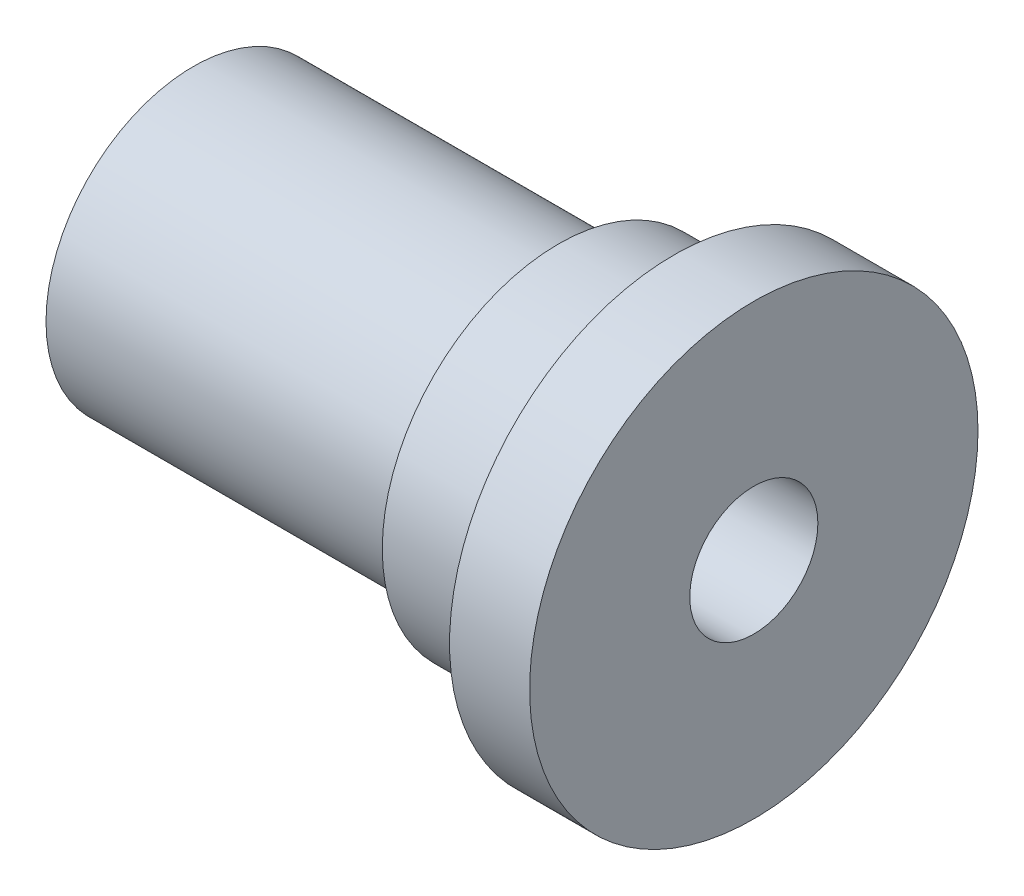
ISO-10303-21;
HEADER;
FILE_DESCRIPTION(('STEP AP214'),'2;1');
FILE_NAME('part.step','',(''),(''),'','','');
FILE_SCHEMA(('AUTOMOTIVE_DESIGN { 1 0 10303 214 1 1 1 1 }'));
ENDSEC;
DATA;
#1=APPLICATION_CONTEXT('core data for automotive mechanical design processes');
#2=APPLICATION_PROTOCOL_DEFINITION('international standard','automotive_design',2000,#1);
#3=PRODUCT_CONTEXT('',#1,'mechanical');
#4=PRODUCT('Part','Part','',(#3));
#5=PRODUCT_RELATED_PRODUCT_CATEGORY('part','',(#4));
#6=PRODUCT_DEFINITION_FORMATION('','',#4);
#7=PRODUCT_DEFINITION_CONTEXT('part definition',#1,'design');
#8=PRODUCT_DEFINITION('design','',#6,#7);
#9=PRODUCT_DEFINITION_SHAPE('','',#8);
#10=(LENGTH_UNIT() NAMED_UNIT(*) SI_UNIT(.MILLI.,.METRE.));
#11=(NAMED_UNIT(*) PLANE_ANGLE_UNIT() SI_UNIT($,.RADIAN.));
#12=(NAMED_UNIT(*) SI_UNIT($,.STERADIAN.) SOLID_ANGLE_UNIT());
#13=UNCERTAINTY_MEASURE_WITH_UNIT(LENGTH_MEASURE(1.E-05),#10,'distance_accuracy_value','');
#14=(GEOMETRIC_REPRESENTATION_CONTEXT(3) GLOBAL_UNCERTAINTY_ASSIGNED_CONTEXT((#13)) GLOBAL_UNIT_ASSIGNED_CONTEXT((#10,
#11,#12)) REPRESENTATION_CONTEXT('',''));
#15=CARTESIAN_POINT('',(0.,0.,0.));
#16=DIRECTION('',(0.,0.,1.));
#17=DIRECTION('',(1.,0.,0.));
#18=AXIS2_PLACEMENT_3D('',#15,#16,#17);
#19=CARTESIAN_POINT('',(-7.2,0.,-11.));
#20=DIRECTION('',(-1.,0.,0.));
#21=DIRECTION('',(0.,0.,1.));
#22=AXIS2_PLACEMENT_3D('',#19,#20,#21);
#23=PLANE('',#22);
#24=CARTESIAN_POINT('',(-7.2,0.,0.));
#25=DIRECTION('',(1.,0.,0.));
#26=DIRECTION('',(0.,0.,-1.));
#27=AXIS2_PLACEMENT_3D('',#24,#25,#26);
#28=CIRCLE('',#27,9.19999999999999);
#29=CARTESIAN_POINT('',(-7.2,0.,-9.2));
#30=VERTEX_POINT('',#29);
#31=EDGE_CURVE('E66',#30,#30,#28,.T.);
#32=ORIENTED_EDGE('',*,*,#31,.T.);
#33=EDGE_LOOP('',(#32));
#34=FACE_BOUND('',#33,.T.);
#35=CARTESIAN_POINT('',(-7.2,0.,0.));
#36=DIRECTION('',(1.,0.,0.));
#37=DIRECTION('',(0.,0.,-1.));
#38=AXIS2_PLACEMENT_3D('',#35,#36,#37);
#39=CIRCLE('',#38,11.);
#40=CARTESIAN_POINT('',(-7.2,0.,-11.));
#41=VERTEX_POINT('',#40);
#42=EDGE_CURVE('E10',#41,#41,#39,.T.);
#43=ORIENTED_EDGE('',*,*,#42,.F.);
#44=EDGE_LOOP('',(#43));
#45=FACE_BOUND('',#44,.T.);
#46=ADVANCED_FACE('F33',(#34,#45),#23,.T.);
#47=CARTESIAN_POINT('',(-18.,0.,0.));
#48=DIRECTION('',(1.,0.,0.));
#49=DIRECTION('',(0.,0.,-1.));
#50=AXIS2_PLACEMENT_3D('',#47,#48,#49);
#51=CYLINDRICAL_SURFACE('',#50,11.);
#52=ORIENTED_EDGE('',*,*,#42,.T.);
#53=EDGE_LOOP('',(#52));
#54=FACE_BOUND('',#53,.T.);
#55=CARTESIAN_POINT('',(0.,0.,0.));
#56=DIRECTION('',(1.,0.,0.));
#57=DIRECTION('',(0.,0.,-1.));
#58=AXIS2_PLACEMENT_3D('',#55,#56,#57);
#59=CIRCLE('',#58,11.);
#60=CARTESIAN_POINT('',(0.,0.,-11.));
#61=VERTEX_POINT('',#60);
#62=EDGE_CURVE('E45',#61,#61,#59,.T.);
#63=ORIENTED_EDGE('',*,*,#62,.F.);
#64=EDGE_LOOP('',(#63));
#65=FACE_BOUND('',#64,.T.);
#66=ADVANCED_FACE('F101',(#54,#65),#51,.T.);
#67=CARTESIAN_POINT('',(0.,0.,-11.));
#68=DIRECTION('',(-1.,0.,0.));
#69=DIRECTION('',(0.,0.,1.));
#70=AXIS2_PLACEMENT_3D('',#67,#68,#69);
#71=PLANE('',#70);
#72=ORIENTED_EDGE('',*,*,#62,.T.);
#73=EDGE_LOOP('',(#72));
#74=FACE_BOUND('',#73,.T.);
#75=CARTESIAN_POINT('',(0.,0.,0.));
#76=DIRECTION('',(1.,0.,0.));
#77=DIRECTION('',(0.,0.,-1.));
#78=AXIS2_PLACEMENT_3D('',#75,#76,#77);
#79=CIRCLE('',#78,14.);
#80=CARTESIAN_POINT('',(0.,0.,-14.));
#81=VERTEX_POINT('',#80);
#82=EDGE_CURVE('E49',#81,#81,#79,.T.);
#83=ORIENTED_EDGE('',*,*,#82,.F.);
#84=EDGE_LOOP('',(#83));
#85=FACE_BOUND('',#84,.T.);
#86=ADVANCED_FACE('F106',(#74,#85),#71,.T.);
#87=CARTESIAN_POINT('',(-18.,0.,0.));
#88=DIRECTION('',(1.,0.,0.));
#89=DIRECTION('',(0.,0.,-1.));
#90=AXIS2_PLACEMENT_3D('',#87,#88,#89);
#91=CYLINDRICAL_SURFACE('',#90,14.);
#92=ORIENTED_EDGE('',*,*,#82,.T.);
#93=EDGE_LOOP('',(#92));
#94=FACE_BOUND('',#93,.T.);
#95=CARTESIAN_POINT('',(5.,0.,0.));
#96=DIRECTION('',(1.,0.,0.));
#97=DIRECTION('',(0.,0.,-1.));
#98=AXIS2_PLACEMENT_3D('',#95,#96,#97);
#99=CIRCLE('',#98,14.);
#100=CARTESIAN_POINT('',(5.,0.,-14.));
#101=VERTEX_POINT('',#100);
#102=EDGE_CURVE('E54',#101,#101,#99,.T.);
#103=ORIENTED_EDGE('',*,*,#102,.F.);
#104=EDGE_LOOP('',(#103));
#105=FACE_BOUND('',#104,.T.);
#106=ADVANCED_FACE('F113',(#94,#105),#91,.T.);
#107=CARTESIAN_POINT('',(5.,0.,-14.));
#108=DIRECTION('',(1.,0.,0.));
#109=DIRECTION('',(0.,0.,-1.));
#110=AXIS2_PLACEMENT_3D('',#107,#108,#109);
#111=PLANE('',#110);
#112=ORIENTED_EDGE('',*,*,#102,.T.);
#113=EDGE_LOOP('',(#112));
#114=FACE_BOUND('',#113,.T.);
#115=CARTESIAN_POINT('',(5.,0.,0.));
#116=DIRECTION('',(1.,0.,0.));
#117=DIRECTION('',(0.,0.,-1.));
#118=AXIS2_PLACEMENT_3D('',#115,#116,#117);
#119=CIRCLE('',#118,4.);
#120=CARTESIAN_POINT('',(5.,0.,-4.));
#121=VERTEX_POINT('',#120);
#122=EDGE_CURVE('E57',#121,#121,#119,.T.);
#123=ORIENTED_EDGE('',*,*,#122,.F.);
#124=EDGE_LOOP('',(#123));
#125=FACE_BOUND('',#124,.T.);
#126=ADVANCED_FACE('F98',(#114,#125),#111,.T.);
#127=CARTESIAN_POINT('',(-18.,0.,0.));
#128=DIRECTION('',(1.,0.,0.));
#129=DIRECTION('',(0.,0.,-1.));
#130=AXIS2_PLACEMENT_3D('',#127,#128,#129);
#131=CYLINDRICAL_SURFACE('',#130,4.);
#132=CARTESIAN_POINT('',(-11.,-3.12249899919919,2.5));
#133=CARTESIAN_POINT('',(-10.9378432485545,-3.1224999155542,2.4999994109714));
#134=CARTESIAN_POINT('',(-10.8756740533292,-3.12436490733916,2.49767581942173));
#135=CARTESIAN_POINT('',(-10.7518828204523,-3.13172923119025,2.48843349840857));
#136=CARTESIAN_POINT('',(-10.6902611267429,-3.13723070381364,2.48151206248433));
#137=CARTESIAN_POINT('',(-10.5067739522563,-3.15888953558504,2.45397595058365));
#138=CARTESIAN_POINT('',(-10.386451668811,-3.18020036271142,2.42658990946459));
#139=CARTESIAN_POINT('',(-10.1544018021218,-3.23299770760367,2.35576217141198));
#140=CARTESIAN_POINT('',(-10.0426095849449,-3.26439575383209,2.31245961359202));
#141=CARTESIAN_POINT('',(-9.82799147466594,-3.33366000884439,2.21143916430899));
#142=CARTESIAN_POINT('',(-9.72516582624691,-3.37152639405534,2.15372087963017));
#143=CARTESIAN_POINT('',(-9.51626601869634,-3.45559225121875,2.01647682425578));
#144=CARTESIAN_POINT('',(-9.41160667499548,-3.50222814511577,1.93506425666949));
#145=CARTESIAN_POINT('',(-9.2162384483762,-3.59505503533367,1.75662526657432));
#146=CARTESIAN_POINT('',(-9.12554172004638,-3.64124561158438,1.65958538899782));
#147=CARTESIAN_POINT('',(-8.94977970182732,-3.73459524771314,1.43833990582854));
#148=CARTESIAN_POINT('',(-8.86671381554957,-3.78119887781504,1.31226934259652));
#149=CARTESIAN_POINT('',(-8.75945484526376,-3.84307251838774,1.11163395543429));
#150=CARTESIAN_POINT('',(-8.72658486166689,-3.86236283092051,1.04281240974104));
#151=CARTESIAN_POINT('',(-8.66704531463672,-3.89770436975436,0.901758767615551));
#152=CARTESIAN_POINT('',(-8.64037146896158,-3.91375783207117,0.829529068393798));
#153=CARTESIAN_POINT('',(-8.59601618474372,-3.94066759113823,0.689700297916578));
#154=CARTESIAN_POINT('',(-8.57769802348189,-3.95188535984465,0.62237198127859));
#155=CARTESIAN_POINT('',(-8.54669771368665,-3.97096241909161,0.485997575898809));
#156=CARTESIAN_POINT('',(-8.53401231078379,-3.97882364879721,0.416952503441684));
#157=CARTESIAN_POINT('',(-8.51448620236546,-3.99095470334737,0.277765449857175));
#158=CARTESIAN_POINT('',(-8.50764188348659,-3.99522674847834,0.207624174243907));
#159=CARTESIAN_POINT('',(-8.49990078661078,-4.00006125072437,0.0669114466599399));
#160=CARTESIAN_POINT('',(-8.49900332403665,-4.00062413482248,-0.00365995486027804));
#161=CARTESIAN_POINT('',(-8.50472537354725,-3.99704479619502,-0.196045081555538));
#162=CARTESIAN_POINT('',(-8.51730650307888,-3.98917040897436,-0.317681845488535));
#163=CARTESIAN_POINT('',(-8.55973021796612,-3.96290903275931,-0.556636494620255));
#164=CARTESIAN_POINT('',(-8.58957410797362,-3.94452124920477,-0.673954052677426));
#165=CARTESIAN_POINT('',(-8.66520855928326,-3.89876170711609,-0.901771991763866));
#166=CARTESIAN_POINT('',(-8.71103991957107,-3.87136697381047,-1.01225407159606));
#167=CARTESIAN_POINT('',(-8.81693723898429,-3.80971291751354,-1.22404012071223));
#168=CARTESIAN_POINT('',(-8.87700644106365,-3.77545203089318,-1.32534199174245));
#169=CARTESIAN_POINT('',(-9.01805641692367,-3.69786441247166,-1.52942649744658));
#170=CARTESIAN_POINT('',(-9.10070927669048,-3.65394006381521,-1.63082454612907));
#171=CARTESIAN_POINT('',(-9.28026473720707,-3.56390927740507,-1.81919733573062));
#172=CARTESIAN_POINT('',(-9.37718804638397,-3.51779973570409,-1.90615071842624));
#173=CARTESIAN_POINT('',(-9.59741125317348,-3.42142883464466,-2.07470887167909));
#174=CARTESIAN_POINT('',(-9.72250276335808,-3.37141162686597,-2.15413229677844));
#175=CARTESIAN_POINT('',(-9.98729223730141,-3.28028278192382,-2.29052307550563));
#176=CARTESIAN_POINT('',(-10.1269626874531,-3.23915480386931,-2.34753179448504));
#177=CARTESIAN_POINT('',(-10.3795388061062,-3.18183753131763,-2.42437133527931));
#178=CARTESIAN_POINT('',(-10.4898219252135,-3.16193408602513,-2.45003683445404));
#179=CARTESIAN_POINT('',(-10.7142303775599,-3.13358277759547,-2.48620337073091));
#180=CARTESIAN_POINT('',(-10.8283502426568,-3.12511926504439,-2.49672512520811));
#181=CARTESIAN_POINT('',(-11.0574573605024,-3.12092267030677,-2.5019707209518));
#182=CARTESIAN_POINT('',(-11.1724460004785,-3.12521876170185,-2.49665835896695));
#183=CARTESIAN_POINT('',(-11.3995611643185,-3.14592085836188,-2.47051466367814));
#184=CARTESIAN_POINT('',(-11.5116852383712,-3.16233689222906,-2.44967047849126));
#185=CARTESIAN_POINT('',(-11.7284367594257,-3.20460120797143,-2.39409874195038));
#186=CARTESIAN_POINT('',(-11.8331573158943,-3.23028954367817,-2.35960571424757));
#187=CARTESIAN_POINT('',(-12.0355746998938,-3.28831148388749,-2.27804893702243));
#188=CARTESIAN_POINT('',(-12.133269018878,-3.32064744602081,-2.23098072583746));
#189=CARTESIAN_POINT('',(-12.3386119416632,-3.39574401285203,-2.11530798730694));
#190=CARTESIAN_POINT('',(-12.4446145273018,-3.43931724293015,-2.04430931160543));
#191=CARTESIAN_POINT('',(-12.6443706606543,-3.52787943213338,-1.88737868921489));
#192=CARTESIAN_POINT('',(-12.7381113212423,-3.57286982004467,-1.80143124902619));
#193=CARTESIAN_POINT('',(-12.925964070641,-3.66766209459505,-1.6007693249212));
#194=CARTESIAN_POINT('',(-13.0177273984849,-3.71707933883201,-1.48365201617176));
#195=CARTESIAN_POINT('',(-13.1801470147197,-3.80768973398606,-1.23256787407809));
#196=CARTESIAN_POINT('',(-13.2508131951269,-3.84888673619009,-1.09860897940973));
#197=CARTESIAN_POINT('',(-13.336581067975,-3.89988966499776,-0.891930804655075));
#198=CARTESIAN_POINT('',(-13.3612974439513,-3.91477055097245,-0.824318196039414));
#199=CARTESIAN_POINT('',(-13.4049382767323,-3.94124643918618,-0.686640792876416));
#200=CARTESIAN_POINT('',(-13.4238660861509,-3.95284334314805,-0.616577444051129));
#201=CARTESIAN_POINT('',(-13.4556058301393,-3.9723851203995,-0.474639231464257));
#202=CARTESIAN_POINT('',(-13.4684230995164,-3.98033317908836,-0.402766005755501));
#203=CARTESIAN_POINT('',(-13.4877391722929,-3.99234168343343,-0.257881807142455));
#204=CARTESIAN_POINT('',(-13.4942390209308,-3.99640277220024,-0.184871024482528));
#205=CARTESIAN_POINT('',(-13.5030715155071,-4.00191521492706,0.013110277424899));
#206=CARTESIAN_POINT('',(-13.4992657929094,-3.99952706123947,0.138539079205457));
#207=CARTESIAN_POINT('',(-13.4730824104545,-3.98321975018362,0.386583137102138));
#208=CARTESIAN_POINT('',(-13.4507055933212,-3.96930111604857,0.509198520626837));
#209=CARTESIAN_POINT('',(-13.3896775844539,-3.93192083384285,0.744080605483855));
#210=CARTESIAN_POINT('',(-13.3516179264353,-3.90880701054803,0.856558752631817));
#211=CARTESIAN_POINT('',(-13.2608805375565,-3.85489971248843,1.07343034721918));
#212=CARTESIAN_POINT('',(-13.2082003404328,-3.82410494215308,1.17782242685803));
#213=CARTESIAN_POINT('',(-13.08367872128,-3.75350673935648,1.38731297754798));
#214=CARTESIAN_POINT('',(-13.0104160092425,-3.71310001864656,1.4913601218378));
#215=CARTESIAN_POINT('',(-12.8498467674859,-3.62867283985205,1.68643334934803));
#216=CARTESIAN_POINT('',(-12.7625243911657,-3.58464833191203,1.77744451843681));
#217=CARTESIAN_POINT('',(-12.5617674849381,-3.49000828219718,1.95744716561589));
#218=CARTESIAN_POINT('',(-12.4463833874286,-3.43935738427103,2.04425661250064));
#219=CARTESIAN_POINT('',(-12.2007105902402,-3.34349647457111,2.19754648509905));
#220=CARTESIAN_POINT('',(-12.0704301888475,-3.29828346204189,2.26403815415028));
#221=CARTESIAN_POINT('',(-11.8271946992151,-3.2285953978009,2.36198229412841));
#222=CARTESIAN_POINT('',(-11.7167294278464,-3.20174639338769,2.3979245857683));
#223=CARTESIAN_POINT('',(-11.4900606569982,-3.15878358104509,2.45425618419746));
#224=CARTESIAN_POINT('',(-11.3738765802003,-3.14263581150428,2.47469472410168));
#225=CARTESIAN_POINT('',(-11.2139400053539,-3.12952857640607,2.49119847139522));
#226=CARTESIAN_POINT('',(-11.1712744742913,-3.1268999430677,2.4944943383796));
#227=CARTESIAN_POINT('',(-11.0857413010483,-3.12338461939862,2.49889558125807));
#228=CARTESIAN_POINT('',(-11.0428736107566,-3.12249836712871,2.50000040629188));
#229=CARTESIAN_POINT('',(-11.,-3.12249899919919,2.5));
#230=B_SPLINE_CURVE_WITH_KNOTS('',3,(#132,#133,#134,#135,#136,#137,#138,#139,#140,#141,#142,
#143,#144,#145,#146,#147,#148,#149,#150,#151,#152,#153,#154,#155,#156,#157,#158,#159,#160,#161,
#162,#163,#164,#165,#166,#167,#168,#169,#170,#171,#172,#173,#174,#175,#176,#177,#178,#179,#180,
#181,#182,#183,#184,#185,#186,#187,#188,#189,#190,#191,#192,#193,#194,#195,#196,#197,#198,#199,
#200,#201,#202,#203,#204,#205,#206,#207,#208,#209,#210,#211,#212,#213,#214,#215,#216,#217,#218,
#219,#220,#221,#222,#223,#224,#225,#226,#227,#228,#229),.UNSPECIFIED.,.T.,.F.,(4,2,2,2,2,2,2,2,
2,2,2,2,2,2,2,2,2,2,2,2,2,2,2,2,2,2,2,2,2,2,2,2,2,2,2,2,2,2,2,2,2,2,2,2,2,2,2,2,4),(0.,
0.186415315858459,0.372940459994496,0.746478880764687,1.11682668423133,1.48718459072605,
1.9072279868507,2.32763499192879,2.7987602926597,3.03445880867314,3.26999394209509,
3.48170145743206,3.69328649746504,3.90474055342595,4.11617026725867,4.48184709708114,
4.84755156693919,5.21419620193004,5.58092442797435,5.99329080205307,6.40626158573465,
6.87316206383505,7.33919680735486,7.68265621505466,8.02564530559509,8.36941921026407,
8.71347788865091,9.05186495232126,9.39037223519201,9.79332737765188,10.1967026751544,
10.6647326786671,11.1325428866819,11.3527929661039,11.5729152387447,11.7928449800804,
12.0127383271002,12.3871595324234,12.7615637480926,13.1229788842094,13.4844550226785,
13.8834503840958,14.2828986410983,14.7399238503459,15.1966956936287,15.5530255473292,
15.9082190611886,16.0367696833384,16.1653526209168),.UNSPECIFIED.);
#231=CARTESIAN_POINT('',(-11.,-3.12249899919919,2.5));
#232=VERTEX_POINT('',#231);
#233=EDGE_CURVE('E69',#232,#232,#230,.T.);
#234=ORIENTED_EDGE('',*,*,#233,.F.);
#235=EDGE_LOOP('',(#234));
#236=FACE_BOUND('',#235,.T.);
#237=ORIENTED_EDGE('',*,*,#122,.T.);
#238=EDGE_LOOP('',(#237));
#239=FACE_BOUND('',#238,.T.);
#240=CARTESIAN_POINT('',(-18.,0.,0.));
#241=DIRECTION('',(1.,0.,0.));
#242=DIRECTION('',(0.,0.,-1.));
#243=AXIS2_PLACEMENT_3D('',#240,#241,#242);
#244=CIRCLE('',#243,4.);
#245=CARTESIAN_POINT('',(-18.,0.,-4.));
#246=VERTEX_POINT('',#245);
#247=EDGE_CURVE('E60',#246,#246,#244,.T.);
#248=ORIENTED_EDGE('',*,*,#247,.F.);
#249=EDGE_LOOP('',(#248));
#250=FACE_BOUND('',#249,.T.);
#251=ADVANCED_FACE('F75',(#236,#239,#250),#131,.F.);
#252=CARTESIAN_POINT('',(-18.,0.,-4.));
#253=DIRECTION('',(1.,0.,0.));
#254=DIRECTION('',(0.,0.,-1.));
#255=AXIS2_PLACEMENT_3D('',#252,#253,#254);
#256=PLANE('',#255);
#257=ORIENTED_EDGE('',*,*,#247,.T.);
#258=EDGE_LOOP('',(#257));
#259=FACE_BOUND('',#258,.T.);
#260=ADVANCED_FACE('F91',(#259),#256,.T.);
#261=CARTESIAN_POINT('',(-30.,0.,-9.2));
#262=DIRECTION('',(-1.,0.,0.));
#263=DIRECTION('',(0.,0.,1.));
#264=AXIS2_PLACEMENT_3D('',#261,#262,#263);
#265=PLANE('',#264);
#266=CARTESIAN_POINT('',(-30.,0.,0.));
#267=DIRECTION('',(1.,0.,0.));
#268=DIRECTION('',(0.,0.,-1.));
#269=AXIS2_PLACEMENT_3D('',#266,#267,#268);
#270=CIRCLE('',#269,9.2);
#271=CARTESIAN_POINT('',(-30.,0.,-9.2));
#272=VERTEX_POINT('',#271);
#273=EDGE_CURVE('E63',#272,#272,#270,.T.);
#274=ORIENTED_EDGE('',*,*,#273,.F.);
#275=EDGE_LOOP('',(#274));
#276=FACE_BOUND('',#275,.T.);
#277=ADVANCED_FACE('F88',(#276),#265,.T.);
#278=CARTESIAN_POINT('',(-18.,0.,0.));
#279=DIRECTION('',(1.,0.,0.));
#280=DIRECTION('',(0.,0.,-1.));
#281=AXIS2_PLACEMENT_3D('',#278,#279,#280);
#282=CYLINDRICAL_SURFACE('',#281,9.2);
#283=CARTESIAN_POINT('',(-11.,-8.85381273802422,2.5));
#284=CARTESIAN_POINT('',(-11.1376148042566,-8.85381502180112,2.49999688641659));
#285=CARTESIAN_POINT('',(-11.275262139519,-8.85705624026203,2.4885985927202));
#286=CARTESIAN_POINT('',(-11.5465744252871,-8.86963028898469,2.44339742072519));
#287=CARTESIAN_POINT('',(-11.680237445644,-8.878966023072,2.4095838622107));
#288=CARTESIAN_POINT('',(-11.9396167494603,-8.90259542782654,2.32075147686319));
#289=CARTESIAN_POINT('',(-12.0653441957392,-8.91688194189386,2.26576324638478));
#290=CARTESIAN_POINT('',(-12.3058107807696,-8.94879397370022,2.13623903426253));
#291=CARTESIAN_POINT('',(-12.4205489452399,-8.9664197870811,2.06170132159829));
#292=CARTESIAN_POINT('',(-12.6387597004351,-9.00353742905912,1.89312367723107));
#293=CARTESIAN_POINT('',(-12.7419046399423,-9.02306334686668,1.79866704292061));
#294=CARTESIAN_POINT('',(-12.9311014223389,-9.0614873396217,1.59382856754197));
#295=CARTESIAN_POINT('',(-13.0171514352731,-9.08038534717333,1.48344502373173));
#296=CARTESIAN_POINT('',(-13.1710901752532,-9.11580561982221,1.24760558463178));
#297=CARTESIAN_POINT('',(-13.2386519521824,-9.13228298841912,1.12192895100682));
#298=CARTESIAN_POINT('',(-13.3515620808085,-9.16061358045469,0.860477448971234));
#299=CARTESIAN_POINT('',(-13.3969143277691,-9.17246761469195,0.724704356163637));
#300=CARTESIAN_POINT('',(-13.4630541303017,-9.18997484495426,0.450335255737428));
#301=CARTESIAN_POINT('',(-13.484399329844,-9.19576857769188,0.311882799931901));
#302=CARTESIAN_POINT('',(-13.5036748551273,-9.20099429182168,0.0332489542041619));
#303=CARTESIAN_POINT('',(-13.5016092445269,-9.200427377298,-0.106932131442034));
#304=CARTESIAN_POINT('',(-13.4745118202658,-9.19309811939114,-0.381158158890244));
#305=CARTESIAN_POINT('',(-13.4500826843227,-9.18649836272023,-0.515267665534302));
#306=CARTESIAN_POINT('',(-13.3799268760745,-9.16803765311042,-0.777406944312933));
#307=CARTESIAN_POINT('',(-13.3341989664972,-9.15617639452625,-0.905436362771463));
#308=CARTESIAN_POINT('',(-13.2222897222041,-9.12828665777582,-1.15330422467778));
#309=CARTESIAN_POINT('',(-13.1559043890912,-9.112216881675,-1.27304572750112));
#310=CARTESIAN_POINT('',(-13.0047219465635,-9.07763774974876,-1.4998928759133));
#311=CARTESIAN_POINT('',(-12.9199211298836,-9.05912790300216,-1.60699597052374));
#312=CARTESIAN_POINT('',(-12.731125951636,-9.02097545715704,-1.80912372850712));
#313=CARTESIAN_POINT('',(-12.6266063569011,-9.00131555650872,-1.90365512468998));
#314=CARTESIAN_POINT('',(-12.4029955890666,-8.96360826624755,-2.07397130938745));
#315=CARTESIAN_POINT('',(-12.2839034563038,-8.94556098296795,-2.14975486228304));
#316=CARTESIAN_POINT('',(-12.0334258469065,-8.91305079948856,-2.28081910561488));
#317=CARTESIAN_POINT('',(-11.9019642466974,-8.8986124048243,-2.33596082463729));
#318=CARTESIAN_POINT('',(-11.6311451342834,-8.87525674121764,-2.42319620494302));
#319=CARTESIAN_POINT('',(-11.4917896771789,-8.8663380424132,-2.45529583556071));
#320=CARTESIAN_POINT('',(-11.2137638360013,-8.85533757308547,-2.4946752340913));
#321=CARTESIAN_POINT('',(-11.0752058875793,-8.85305262442286,-2.50269285877787));
#322=CARTESIAN_POINT('',(-10.7987281392691,-8.85502159691635,-2.49571762570213));
#323=CARTESIAN_POINT('',(-10.6608082701939,-8.85927479164244,-2.48072732426945));
#324=CARTESIAN_POINT('',(-10.3923979294674,-8.87364409083391,-2.42881327745194));
#325=CARTESIAN_POINT('',(-10.2618137535921,-8.8836403293689,-2.3923375826151));
#326=CARTESIAN_POINT('',(-10.0086180430943,-8.9082512560508,-2.29899419331007));
#327=CARTESIAN_POINT('',(-9.88600758148645,-8.92286656423689,-2.24212376102336));
#328=CARTESIAN_POINT('',(-9.64916518033127,-8.95548250696535,-2.10812175831716));
#329=CARTESIAN_POINT('',(-9.53518675628996,-8.9735524852221,-2.03055938341709));
#330=CARTESIAN_POINT('',(-9.32159232288308,-9.01088072106059,-1.85790589810007));
#331=CARTESIAN_POINT('',(-9.22197912767477,-9.03013921042009,-1.76281136141268));
#332=CARTESIAN_POINT('',(-9.03685622330778,-9.06837743370193,-1.55437176224505));
#333=CARTESIAN_POINT('',(-8.95186234096409,-9.08733125273222,-1.44056285458653));
#334=CARTESIAN_POINT('',(-8.80218292199341,-9.12223029153556,-1.19986672627912));
#335=CARTESIAN_POINT('',(-8.73749630453371,-9.13817567141157,-1.07298020215019));
#336=CARTESIAN_POINT('',(-8.63086917398903,-9.16515840668692,-0.810623503667909));
#337=CARTESIAN_POINT('',(-8.58875770704526,-9.1762325321847,-0.675226774146321));
#338=CARTESIAN_POINT('',(-8.52798676626707,-9.19238702802048,-0.398931252366232));
#339=CARTESIAN_POINT('',(-8.50932187999614,-9.19746878162812,-0.258033737661586));
#340=CARTESIAN_POINT('',(-8.49632378243781,-9.20099786326193,0.0204527537927811));
#341=CARTESIAN_POINT('',(-8.50123527443073,-9.19965114280508,0.158004357212487));
#342=CARTESIAN_POINT('',(-8.53348926773568,-9.19094320247317,0.430246973390003));
#343=CARTESIAN_POINT('',(-8.56083086847314,-9.18358222407216,0.56493810077392));
#344=CARTESIAN_POINT('',(-8.63673541224502,-9.16371647023757,0.826690911011628));
#345=CARTESIAN_POINT('',(-8.68513991109416,-9.15125013989261,0.953801652357354));
#346=CARTESIAN_POINT('',(-8.8016550766183,-9.12247469905771,1.19816965765025));
#347=CARTESIAN_POINT('',(-8.86976858716814,-9.1061650340641,1.31542549644965));
#348=CARTESIAN_POINT('',(-9.02594957530198,-9.07088439289219,1.54025032082483));
#349=CARTESIAN_POINT('',(-9.11451403221774,-9.05185259139413,1.64746448600575));
#350=CARTESIAN_POINT('',(-9.30814733980628,-9.01351072264888,1.84576444201031));
#351=CARTESIAN_POINT('',(-9.41322058266102,-8.99420058259471,1.93684592695735));
#352=CARTESIAN_POINT('',(-9.63980578396376,-8.95697341769533,2.10238129641646));
#353=CARTESIAN_POINT('',(-9.76164119338345,-8.93909883545152,2.1764028683748));
#354=CARTESIAN_POINT('',(-10.0164985501072,-8.90737596862417,2.30280878430173));
#355=CARTESIAN_POINT('',(-10.1495133853112,-8.8935251488393,2.35520676116792));
#356=CARTESIAN_POINT('',(-10.4016243470678,-8.87326297881355,2.43032200329496));
#357=CARTESIAN_POINT('',(-10.5196668084165,-8.8660295143511,2.45638844786652));
#358=CARTESIAN_POINT('',(-10.758464719897,-8.85630368668848,2.49122773677395));
#359=CARTESIAN_POINT('',(-10.8792198306011,-8.85381073362533,2.50000273269387));
#360=CARTESIAN_POINT('',(-11.,-8.85381273802422,2.5));
#361=B_SPLINE_CURVE_WITH_KNOTS('',3,(#283,#284,#285,#286,#287,#288,#289,#290,#291,#292,#293,
#294,#295,#296,#297,#298,#299,#300,#301,#302,#303,#304,#305,#306,#307,#308,#309,#310,#311,#312,
#313,#314,#315,#316,#317,#318,#319,#320,#321,#322,#323,#324,#325,#326,#327,#328,#329,#330,#331,
#332,#333,#334,#335,#336,#337,#338,#339,#340,#341,#342,#343,#344,#345,#346,#347,#348,#349,#350,
#351,#352,#353,#354,#355,#356,#357,#358,#359,#360),.UNSPECIFIED.,.T.,.F.,(4,2,2,2,2,2,2,2,2,2,2,
2,2,2,2,2,2,2,2,2,2,2,2,2,2,2,2,2,2,2,2,2,2,2,2,2,2,2,4),(0.,0.412400090356027,
0.824996818621922,1.23699958864588,1.64903885202078,2.07074980843229,2.49250588331205,
2.92129843022742,3.35001574553008,3.76855458176676,4.18702076896085,4.59453138863729,
5.00206568406356,5.41375956409483,5.82553640016393,6.25042661529702,6.67534482632453,
7.10307444085536,7.53069320677713,7.94506911220319,8.35939898111441,8.765380006602,
9.17141555197286,9.58667227077369,10.0020102284371,10.4298717836297,10.8577105624807,
11.2822619827506,11.7067153810466,12.1176633828659,12.5285948858256,12.9364872243319,
13.3444384482721,13.7636021917668,14.1828776437,14.6118305701628,15.0405126425727,
15.4025082291594,15.7644587696),.UNSPECIFIED.);
#362=CARTESIAN_POINT('',(-11.,-8.85381273802422,2.5));
#363=VERTEX_POINT('',#362);
#364=EDGE_CURVE('E36',#363,#363,#361,.T.);
#365=ORIENTED_EDGE('',*,*,#364,.F.);
#366=EDGE_LOOP('',(#365));
#367=FACE_BOUND('',#366,.T.);
#368=ORIENTED_EDGE('',*,*,#273,.T.);
#369=EDGE_LOOP('',(#368));
#370=FACE_BOUND('',#369,.T.);
#371=ORIENTED_EDGE('',*,*,#31,.F.);
#372=EDGE_LOOP('',(#371));
#373=FACE_BOUND('',#372,.T.);
#374=ADVANCED_FACE('F82',(#367,#370,#373),#282,.T.);
#375=CARTESIAN_POINT('',(-11.,-10.,0.));
#376=DIRECTION('',(0.,1.,0.));
#377=DIRECTION('',(0.,0.,1.));
#378=AXIS2_PLACEMENT_3D('',#375,#376,#377);
#379=CYLINDRICAL_SURFACE('',#378,2.5);
#380=ORIENTED_EDGE('',*,*,#233,.T.);
#381=EDGE_LOOP('',(#380));
#382=FACE_BOUND('',#381,.T.);
#383=ORIENTED_EDGE('',*,*,#364,.T.);
#384=EDGE_LOOP('',(#383));
#385=FACE_BOUND('',#384,.T.);
#386=ADVANCED_FACE('F79',(#382,#385),#379,.F.);
#387=CLOSED_SHELL('',(#46,#66,#86,#106,#126,#251,#260,#277,#374,#386));
#388=MANIFOLD_SOLID_BREP('B2',#387);
#389=ADVANCED_BREP_SHAPE_REPRESENTATION('',(#18,#388),#14);
#390=SHAPE_DEFINITION_REPRESENTATION(#9,#389);
ENDSEC;
END-ISO-10303-21;
